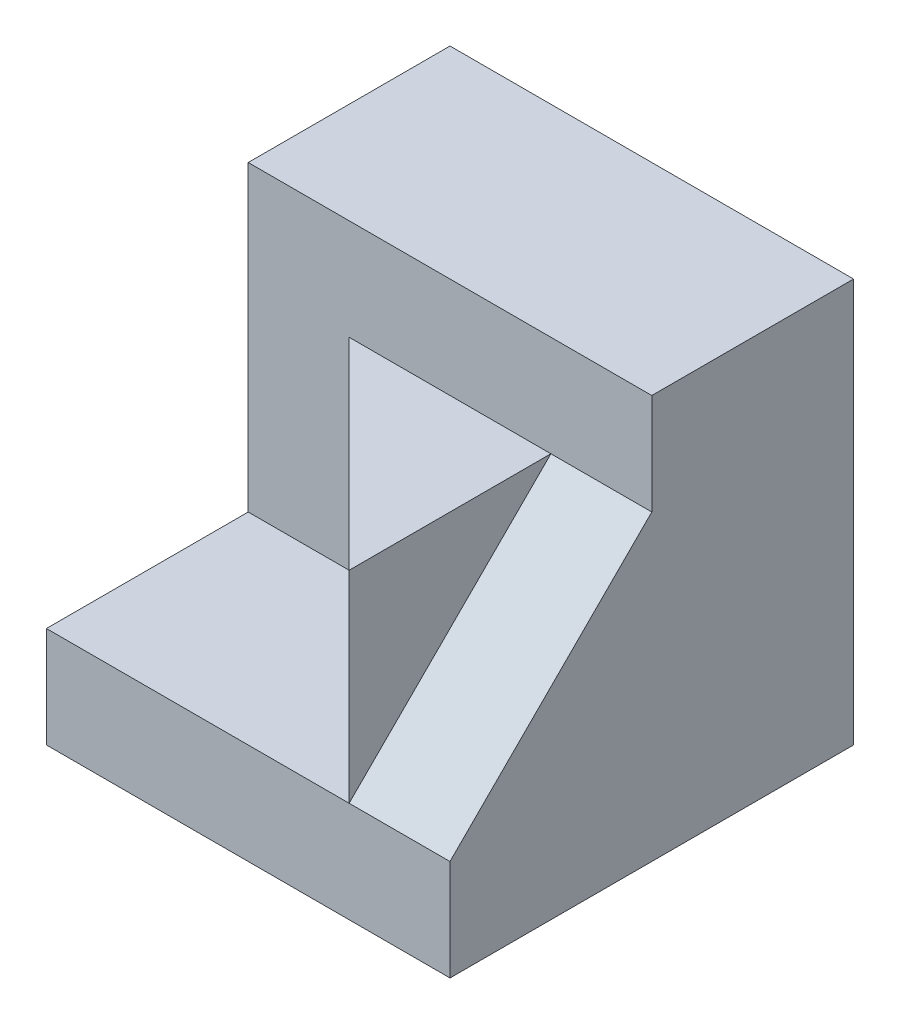
ISO-10303-21;
HEADER;
FILE_DESCRIPTION(('STEP AP214'),'2;1');
FILE_NAME('part.step','',(''),(''),'','','');
FILE_SCHEMA(('AUTOMOTIVE_DESIGN { 1 0 10303 214 1 1 1 1 }'));
ENDSEC;
DATA;
#1=APPLICATION_CONTEXT('core data for automotive mechanical design processes');
#2=APPLICATION_PROTOCOL_DEFINITION('international standard','automotive_design',2000,#1);
#3=PRODUCT_CONTEXT('',#1,'mechanical');
#4=PRODUCT('Part','Part','',(#3));
#5=PRODUCT_RELATED_PRODUCT_CATEGORY('part','',(#4));
#6=PRODUCT_DEFINITION_FORMATION('','',#4);
#7=PRODUCT_DEFINITION_CONTEXT('part definition',#1,'design');
#8=PRODUCT_DEFINITION('design','',#6,#7);
#9=PRODUCT_DEFINITION_SHAPE('','',#8);
#10=(LENGTH_UNIT() NAMED_UNIT(*) SI_UNIT(.MILLI.,.METRE.));
#11=(NAMED_UNIT(*) PLANE_ANGLE_UNIT() SI_UNIT($,.RADIAN.));
#12=(NAMED_UNIT(*) SI_UNIT($,.STERADIAN.) SOLID_ANGLE_UNIT());
#13=UNCERTAINTY_MEASURE_WITH_UNIT(LENGTH_MEASURE(1.E-05),#10,'distance_accuracy_value','');
#14=(GEOMETRIC_REPRESENTATION_CONTEXT(3) GLOBAL_UNCERTAINTY_ASSIGNED_CONTEXT((#13)) GLOBAL_UNIT_ASSIGNED_CONTEXT((#10,
#11,#12)) REPRESENTATION_CONTEXT('',''));
#15=CARTESIAN_POINT('',(0.,0.,0.));
#16=DIRECTION('',(0.,0.,1.));
#17=DIRECTION('',(1.,0.,0.));
#18=AXIS2_PLACEMENT_3D('',#15,#16,#17);
#19=CARTESIAN_POINT('',(3.,1.,0.));
#20=DIRECTION('',(1.,0.,0.));
#21=DIRECTION('',(0.,0.,-1.));
#22=AXIS2_PLACEMENT_3D('',#19,#20,#21);
#23=PLANE('',#22);
#24=DIRECTION('',(0.,1.,0.));
#25=VECTOR('',#24,1.);
#26=CARTESIAN_POINT('',(3.,1.,0.));
#27=LINE('',#26,#25);
#28=CARTESIAN_POINT('',(3.,1.,0.));
#29=VERTEX_POINT('',#28);
#30=CARTESIAN_POINT('',(3.,3.,0.));
#31=VERTEX_POINT('',#30);
#32=EDGE_CURVE('E133',#29,#31,#27,.T.);
#33=ORIENTED_EDGE('',*,*,#32,.F.);
#34=DIRECTION('',(0.,-0.707106781186548,0.707106781186548));
#35=VECTOR('',#34,1.);
#36=CARTESIAN_POINT('',(3.,1.,0.));
#37=LINE('',#36,#35);
#38=CARTESIAN_POINT('',(3.,3.,-2.));
#39=VERTEX_POINT('',#38);
#40=EDGE_CURVE('E205',#39,#29,#37,.T.);
#41=ORIENTED_EDGE('',*,*,#40,.F.);
#42=DIRECTION('',(0.,0.,1.));
#43=VECTOR('',#42,1.);
#44=CARTESIAN_POINT('',(3.,3.,0.));
#45=LINE('',#44,#43);
#46=EDGE_CURVE('E12',#39,#31,#45,.T.);
#47=ORIENTED_EDGE('',*,*,#46,.T.);
#48=EDGE_LOOP('',(#33,#41,#47));
#49=FACE_BOUND('',#48,.T.);
#50=ADVANCED_FACE('F57',(#49),#23,.T.);
#51=CARTESIAN_POINT('',(0.,1.,-2.));
#52=DIRECTION('',(0.,0.,-1.));
#53=DIRECTION('',(-1.,0.,0.));
#54=AXIS2_PLACEMENT_3D('',#51,#52,#53);
#55=PLANE('',#54);
#56=DIRECTION('',(-1.,0.,0.));
#57=VECTOR('',#56,1.);
#58=CARTESIAN_POINT('',(4.,3.,-2.));
#59=LINE('',#58,#57);
#60=CARTESIAN_POINT('',(4.,3.,-2.));
#61=VERTEX_POINT('',#60);
#62=EDGE_CURVE('E72',#61,#39,#59,.T.);
#63=ORIENTED_EDGE('',*,*,#62,.F.);
#64=DIRECTION('',(0.,1.,0.));
#65=VECTOR('',#64,1.);
#66=CARTESIAN_POINT('',(4.,1.,-2.));
#67=LINE('',#66,#65);
#68=CARTESIAN_POINT('',(4.,4.,-2.));
#69=VERTEX_POINT('',#68);
#70=EDGE_CURVE('E134',#61,#69,#67,.T.);
#71=ORIENTED_EDGE('',*,*,#70,.T.);
#72=DIRECTION('',(-1.,0.,0.));
#73=VECTOR('',#72,1.);
#74=CARTESIAN_POINT('',(0.,4.,-2.));
#75=LINE('',#74,#73);
#76=CARTESIAN_POINT('',(0.,4.,-2.));
#77=VERTEX_POINT('',#76);
#78=EDGE_CURVE('E198',#69,#77,#75,.T.);
#79=ORIENTED_EDGE('',*,*,#78,.T.);
#80=DIRECTION('',(0.,1.,0.));
#81=VECTOR('',#80,1.);
#82=CARTESIAN_POINT('',(0.,1.,-2.));
#83=LINE('',#82,#81);
#84=CARTESIAN_POINT('',(0.,1.,-2.));
#85=VERTEX_POINT('',#84);
#86=EDGE_CURVE('E140',#85,#77,#83,.T.);
#87=ORIENTED_EDGE('',*,*,#86,.F.);
#88=DIRECTION('',(-1.,0.,0.));
#89=VECTOR('',#88,1.);
#90=CARTESIAN_POINT('',(0.,1.,-2.));
#91=LINE('',#90,#89);
#92=CARTESIAN_POINT('',(1.,1.,-2.));
#93=VERTEX_POINT('',#92);
#94=EDGE_CURVE('E138',#93,#85,#91,.T.);
#95=ORIENTED_EDGE('',*,*,#94,.F.);
#96=DIRECTION('',(0.,1.,0.));
#97=VECTOR('',#96,1.);
#98=CARTESIAN_POINT('',(1.,1.,-2.));
#99=LINE('',#98,#97);
#100=CARTESIAN_POINT('',(1.,3.,-2.));
#101=VERTEX_POINT('',#100);
#102=EDGE_CURVE('E131',#93,#101,#99,.T.);
#103=ORIENTED_EDGE('',*,*,#102,.T.);
#104=DIRECTION('',(-1.,0.,0.));
#105=VECTOR('',#104,1.);
#106=CARTESIAN_POINT('',(4.,3.,-2.));
#107=LINE('',#106,#105);
#108=EDGE_CURVE('E123',#39,#101,#107,.T.);
#109=ORIENTED_EDGE('',*,*,#108,.F.);
#110=EDGE_LOOP('',(#63,#71,#79,#87,#95,#103,#109));
#111=FACE_BOUND('',#110,.T.);
#112=ADVANCED_FACE('F136',(#111),#55,.F.);
#113=CARTESIAN_POINT('',(1.5,1.,-1.5));
#114=DIRECTION('',(0.707106781186547,0.,-0.707106781186547));
#115=DIRECTION('',(-0.707106781186548,0.,-0.707106781186548));
#116=AXIS2_PLACEMENT_3D('',#113,#114,#115);
#117=PLANE('',#116);
#118=DIRECTION('',(0.707106781186548,0.,0.707106781186548));
#119=VECTOR('',#118,1.);
#120=CARTESIAN_POINT('',(1.5,3.,-1.5));
#121=LINE('',#120,#119);
#122=EDGE_CURVE('E80',#101,#31,#121,.T.);
#123=ORIENTED_EDGE('',*,*,#122,.F.);
#124=ORIENTED_EDGE('',*,*,#102,.F.);
#125=DIRECTION('',(-0.707106781186548,0.,-0.707106781186548));
#126=VECTOR('',#125,1.);
#127=CARTESIAN_POINT('',(1.5,1.,-1.5));
#128=LINE('',#127,#126);
#129=EDGE_CURVE('E211',#29,#93,#128,.T.);
#130=ORIENTED_EDGE('',*,*,#129,.F.);
#131=ORIENTED_EDGE('',*,*,#32,.T.);
#132=EDGE_LOOP('',(#123,#124,#130,#131));
#133=FACE_BOUND('',#132,.T.);
#134=ADVANCED_FACE('F129',(#133),#117,.F.);
#135=CARTESIAN_POINT('',(4.,0.,0.));
#136=DIRECTION('',(0.,0.,-1.));
#137=DIRECTION('',(-1.,0.,0.));
#138=AXIS2_PLACEMENT_3D('',#135,#136,#137);
#139=PLANE('',#138);
#140=DIRECTION('',(1.,0.,0.));
#141=VECTOR('',#140,1.);
#142=CARTESIAN_POINT('',(0.,1.,0.));
#143=LINE('',#142,#141);
#144=CARTESIAN_POINT('',(4.,1.,0.));
#145=VERTEX_POINT('',#144);
#146=EDGE_CURVE('E208',#29,#145,#143,.T.);
#147=ORIENTED_EDGE('',*,*,#146,.F.);
#148=DIRECTION('',(1.,0.,0.));
#149=VECTOR('',#148,1.);
#150=CARTESIAN_POINT('',(0.,1.,0.));
#151=LINE('',#150,#149);
#152=CARTESIAN_POINT('',(0.,1.,0.));
#153=VERTEX_POINT('',#152);
#154=EDGE_CURVE('E141',#153,#29,#151,.T.);
#155=ORIENTED_EDGE('',*,*,#154,.F.);
#156=DIRECTION('',(0.,-1.,0.));
#157=VECTOR('',#156,1.);
#158=CARTESIAN_POINT('',(0.,0.,0.));
#159=LINE('',#158,#157);
#160=CARTESIAN_POINT('',(0.,0.,0.));
#161=VERTEX_POINT('',#160);
#162=EDGE_CURVE('E161',#153,#161,#159,.T.);
#163=ORIENTED_EDGE('',*,*,#162,.T.);
#164=DIRECTION('',(-1.,0.,0.));
#165=VECTOR('',#164,1.);
#166=CARTESIAN_POINT('',(4.,0.,0.));
#167=LINE('',#166,#165);
#168=CARTESIAN_POINT('',(4.,0.,0.));
#169=VERTEX_POINT('',#168);
#170=EDGE_CURVE('E65',#169,#161,#167,.T.);
#171=ORIENTED_EDGE('',*,*,#170,.F.);
#172=DIRECTION('',(0.,-1.,0.));
#173=VECTOR('',#172,1.);
#174=CARTESIAN_POINT('',(4.,0.,0.));
#175=LINE('',#174,#173);
#176=EDGE_CURVE('E150',#145,#169,#175,.T.);
#177=ORIENTED_EDGE('',*,*,#176,.F.);
#178=EDGE_LOOP('',(#147,#155,#163,#171,#177));
#179=FACE_BOUND('',#178,.T.);
#180=ADVANCED_FACE('F59',(#179),#139,.F.);
#181=CARTESIAN_POINT('',(4.,4.,0.));
#182=DIRECTION('',(0.,-1.,0.));
#183=DIRECTION('',(0.,0.,-1.));
#184=AXIS2_PLACEMENT_3D('',#181,#182,#183);
#185=PLANE('',#184);
#186=ORIENTED_EDGE('',*,*,#78,.F.);
#187=DIRECTION('',(0.,0.,1.));
#188=VECTOR('',#187,1.);
#189=CARTESIAN_POINT('',(4.,4.,0.));
#190=LINE('',#189,#188);
#191=CARTESIAN_POINT('',(4.,4.,-4.));
#192=VERTEX_POINT('',#191);
#193=EDGE_CURVE('E157',#192,#69,#190,.T.);
#194=ORIENTED_EDGE('',*,*,#193,.F.);
#195=DIRECTION('',(-1.,0.,0.));
#196=VECTOR('',#195,1.);
#197=CARTESIAN_POINT('',(4.,4.,-4.));
#198=LINE('',#197,#196);
#199=CARTESIAN_POINT('',(0.,4.,-4.));
#200=VERTEX_POINT('',#199);
#201=EDGE_CURVE('E160',#192,#200,#198,.T.);
#202=ORIENTED_EDGE('',*,*,#201,.T.);
#203=DIRECTION('',(0.,0.,1.));
#204=VECTOR('',#203,1.);
#205=CARTESIAN_POINT('',(0.,4.,0.));
#206=LINE('',#205,#204);
#207=EDGE_CURVE('E153',#200,#77,#206,.T.);
#208=ORIENTED_EDGE('',*,*,#207,.T.);
#209=EDGE_LOOP('',(#186,#194,#202,#208));
#210=FACE_BOUND('',#209,.T.);
#211=ADVANCED_FACE('F197',(#210),#185,.F.);
#212=CARTESIAN_POINT('',(4.,0.,0.));
#213=DIRECTION('',(-1.,0.,0.));
#214=DIRECTION('',(0.,0.,1.));
#215=AXIS2_PLACEMENT_3D('',#212,#213,#214);
#216=PLANE('',#215);
#217=ORIENTED_EDGE('',*,*,#70,.F.);
#218=DIRECTION('',(0.,-0.707106781186548,0.707106781186548));
#219=VECTOR('',#218,1.);
#220=CARTESIAN_POINT('',(4.,1.,0.));
#221=LINE('',#220,#219);
#222=EDGE_CURVE('E202',#61,#145,#221,.T.);
#223=ORIENTED_EDGE('',*,*,#222,.T.);
#224=ORIENTED_EDGE('',*,*,#176,.T.);
#225=DIRECTION('',(0.,0.,-1.));
#226=VECTOR('',#225,1.);
#227=CARTESIAN_POINT('',(4.,0.,0.));
#228=LINE('',#227,#226);
#229=CARTESIAN_POINT('',(4.,0.,-4.));
#230=VERTEX_POINT('',#229);
#231=EDGE_CURVE('E152',#169,#230,#228,.T.);
#232=ORIENTED_EDGE('',*,*,#231,.T.);
#233=DIRECTION('',(0.,1.,0.));
#234=VECTOR('',#233,1.);
#235=CARTESIAN_POINT('',(4.,0.,-4.));
#236=LINE('',#235,#234);
#237=EDGE_CURVE('E155',#230,#192,#236,.T.);
#238=ORIENTED_EDGE('',*,*,#237,.T.);
#239=ORIENTED_EDGE('',*,*,#193,.T.);
#240=EDGE_LOOP('',(#217,#223,#224,#232,#238,#239));
#241=FACE_BOUND('',#240,.T.);
#242=ADVANCED_FACE('F200',(#241),#216,.F.);
#243=CARTESIAN_POINT('',(4.,0.,0.));
#244=DIRECTION('',(0.,1.,0.));
#245=DIRECTION('',(0.,0.,1.));
#246=AXIS2_PLACEMENT_3D('',#243,#244,#245);
#247=PLANE('',#246);
#248=DIRECTION('',(0.,0.,-1.));
#249=VECTOR('',#248,1.);
#250=CARTESIAN_POINT('',(0.,0.,0.));
#251=LINE('',#250,#249);
#252=CARTESIAN_POINT('',(0.,0.,-4.));
#253=VERTEX_POINT('',#252);
#254=EDGE_CURVE('E163',#161,#253,#251,.T.);
#255=ORIENTED_EDGE('',*,*,#254,.T.);
#256=DIRECTION('',(-1.,0.,0.));
#257=VECTOR('',#256,1.);
#258=CARTESIAN_POINT('',(4.,0.,-4.));
#259=LINE('',#258,#257);
#260=EDGE_CURVE('E171',#230,#253,#259,.T.);
#261=ORIENTED_EDGE('',*,*,#260,.F.);
#262=ORIENTED_EDGE('',*,*,#231,.F.);
#263=ORIENTED_EDGE('',*,*,#170,.T.);
#264=EDGE_LOOP('',(#255,#261,#262,#263));
#265=FACE_BOUND('',#264,.T.);
#266=ADVANCED_FACE('F177',(#265),#247,.F.);
#267=CARTESIAN_POINT('',(4.,0.,-4.));
#268=DIRECTION('',(0.,0.,1.));
#269=DIRECTION('',(1.,0.,0.));
#270=AXIS2_PLACEMENT_3D('',#267,#268,#269);
#271=PLANE('',#270);
#272=DIRECTION('',(0.,1.,0.));
#273=VECTOR('',#272,1.);
#274=CARTESIAN_POINT('',(0.,0.,-4.));
#275=LINE('',#274,#273);
#276=EDGE_CURVE('E165',#253,#200,#275,.T.);
#277=ORIENTED_EDGE('',*,*,#276,.T.);
#278=ORIENTED_EDGE('',*,*,#201,.F.);
#279=ORIENTED_EDGE('',*,*,#237,.F.);
#280=ORIENTED_EDGE('',*,*,#260,.T.);
#281=EDGE_LOOP('',(#277,#278,#279,#280));
#282=FACE_BOUND('',#281,.T.);
#283=ADVANCED_FACE('F192',(#282),#271,.F.);
#284=CARTESIAN_POINT('',(0.,0.,0.));
#285=DIRECTION('',(-1.,0.,0.));
#286=DIRECTION('',(0.,0.,1.));
#287=AXIS2_PLACEMENT_3D('',#284,#285,#286);
#288=PLANE('',#287);
#289=ORIENTED_EDGE('',*,*,#86,.T.);
#290=ORIENTED_EDGE('',*,*,#207,.F.);
#291=ORIENTED_EDGE('',*,*,#276,.F.);
#292=ORIENTED_EDGE('',*,*,#254,.F.);
#293=ORIENTED_EDGE('',*,*,#162,.F.);
#294=DIRECTION('',(0.,0.,1.));
#295=VECTOR('',#294,1.);
#296=CARTESIAN_POINT('',(0.,1.,0.));
#297=LINE('',#296,#295);
#298=EDGE_CURVE('E146',#85,#153,#297,.T.);
#299=ORIENTED_EDGE('',*,*,#298,.F.);
#300=EDGE_LOOP('',(#289,#290,#291,#292,#293,#299));
#301=FACE_BOUND('',#300,.T.);
#302=ADVANCED_FACE('F188',(#301),#288,.T.);
#303=CARTESIAN_POINT('',(0.,1.,0.));
#304=DIRECTION('',(0.,1.,0.));
#305=DIRECTION('',(0.,0.,1.));
#306=AXIS2_PLACEMENT_3D('',#303,#304,#305);
#307=PLANE('',#306);
#308=ORIENTED_EDGE('',*,*,#129,.T.);
#309=ORIENTED_EDGE('',*,*,#94,.T.);
#310=ORIENTED_EDGE('',*,*,#298,.T.);
#311=ORIENTED_EDGE('',*,*,#154,.T.);
#312=EDGE_LOOP('',(#308,#309,#310,#311));
#313=FACE_BOUND('',#312,.T.);
#314=ADVANCED_FACE('F218',(#313),#307,.T.);
#315=CARTESIAN_POINT('',(0.,3.,0.));
#316=DIRECTION('',(0.,1.,0.));
#317=DIRECTION('',(0.,0.,1.));
#318=AXIS2_PLACEMENT_3D('',#315,#316,#317);
#319=PLANE('',#318);
#320=ORIENTED_EDGE('',*,*,#122,.T.);
#321=ORIENTED_EDGE('',*,*,#46,.F.);
#322=ORIENTED_EDGE('',*,*,#108,.T.);
#323=EDGE_LOOP('',(#320,#321,#322));
#324=FACE_BOUND('',#323,.T.);
#325=ADVANCED_FACE('F124',(#324),#319,.T.);
#326=CARTESIAN_POINT('',(4.,1.,0.));
#327=DIRECTION('',(0.,-0.707106781186547,-0.707106781186547));
#328=DIRECTION('',(0.,0.707106781186548,-0.707106781186548));
#329=AXIS2_PLACEMENT_3D('',#326,#327,#328);
#330=PLANE('',#329);
#331=ORIENTED_EDGE('',*,*,#40,.T.);
#332=ORIENTED_EDGE('',*,*,#146,.T.);
#333=ORIENTED_EDGE('',*,*,#222,.F.);
#334=ORIENTED_EDGE('',*,*,#62,.T.);
#335=EDGE_LOOP('',(#331,#332,#333,#334));
#336=FACE_BOUND('',#335,.T.);
#337=ADVANCED_FACE('F209',(#336),#330,.F.);
#338=CLOSED_SHELL('',(#50,#112,#134,#180,#211,#242,#266,#283,#302,#314,#325,#337));
#339=MANIFOLD_SOLID_BREP('B2',#338);
#340=ADVANCED_BREP_SHAPE_REPRESENTATION('',(#18,#339),#14);
#341=SHAPE_DEFINITION_REPRESENTATION(#9,#340);
ENDSEC;
END-ISO-10303-21;
